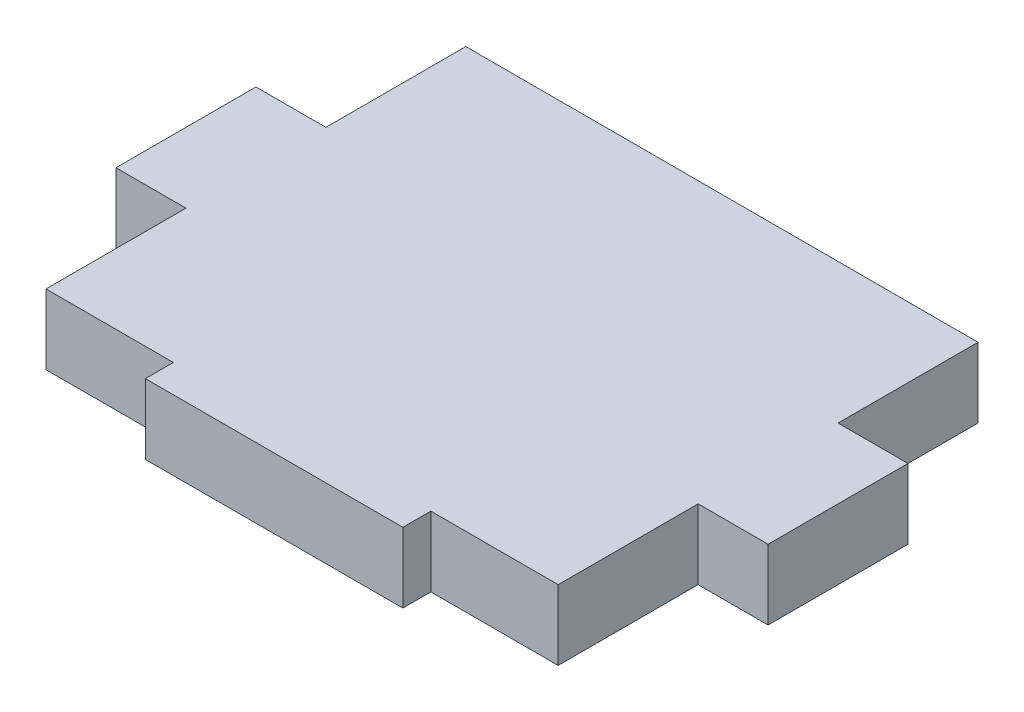
ISO-10303-21;
HEADER;
FILE_DESCRIPTION(('STEP AP214'),'2;1');
FILE_NAME('part.step','',(''),(''),'','','');
FILE_SCHEMA(('AUTOMOTIVE_DESIGN { 1 0 10303 214 1 1 1 1 }'));
ENDSEC;
DATA;
#1=APPLICATION_CONTEXT('core data for automotive mechanical design processes');
#2=APPLICATION_PROTOCOL_DEFINITION('international standard','automotive_design',2000,#1);
#3=PRODUCT_CONTEXT('',#1,'mechanical');
#4=PRODUCT('Part','Part','',(#3));
#5=PRODUCT_RELATED_PRODUCT_CATEGORY('part','',(#4));
#6=PRODUCT_DEFINITION_FORMATION('','',#4);
#7=PRODUCT_DEFINITION_CONTEXT('part definition',#1,'design');
#8=PRODUCT_DEFINITION('design','',#6,#7);
#9=PRODUCT_DEFINITION_SHAPE('','',#8);
#10=(LENGTH_UNIT() NAMED_UNIT(*) SI_UNIT(.MILLI.,.METRE.));
#11=(NAMED_UNIT(*) PLANE_ANGLE_UNIT() SI_UNIT($,.RADIAN.));
#12=(NAMED_UNIT(*) SI_UNIT($,.STERADIAN.) SOLID_ANGLE_UNIT());
#13=UNCERTAINTY_MEASURE_WITH_UNIT(LENGTH_MEASURE(1.E-05),#10,'distance_accuracy_value','');
#14=(GEOMETRIC_REPRESENTATION_CONTEXT(3) GLOBAL_UNCERTAINTY_ASSIGNED_CONTEXT((#13)) GLOBAL_UNIT_ASSIGNED_CONTEXT((#10,
#11,#12)) REPRESENTATION_CONTEXT('',''));
#15=CARTESIAN_POINT('',(0.,0.,0.));
#16=DIRECTION('',(0.,0.,1.));
#17=DIRECTION('',(1.,0.,0.));
#18=AXIS2_PLACEMENT_3D('',#15,#16,#17);
#19=CARTESIAN_POINT('',(23.241,3.175,19.05));
#20=DIRECTION('',(-1.,0.,0.));
#21=DIRECTION('',(0.,0.,1.));
#22=AXIS2_PLACEMENT_3D('',#19,#20,#21);
#23=PLANE('',#22);
#24=DIRECTION('',(0.,1.,0.));
#25=VECTOR('',#24,1.);
#26=CARTESIAN_POINT('',(23.241,-3.175,-6.35));
#27=LINE('',#26,#25);
#28=CARTESIAN_POINT('',(23.241,-3.175,-6.35));
#29=VERTEX_POINT('',#28);
#30=CARTESIAN_POINT('',(23.241,3.175,-6.35));
#31=VERTEX_POINT('',#30);
#32=EDGE_CURVE('E177',#29,#31,#27,.T.);
#33=ORIENTED_EDGE('',*,*,#32,.F.);
#34=DIRECTION('',(0.,0.,-1.));
#35=VECTOR('',#34,1.);
#36=CARTESIAN_POINT('',(23.241,-3.175,19.05));
#37=LINE('',#36,#35);
#38=CARTESIAN_POINT('',(23.241,-3.175,-19.05));
#39=VERTEX_POINT('',#38);
#40=EDGE_CURVE('E218',#29,#39,#37,.T.);
#41=ORIENTED_EDGE('',*,*,#40,.T.);
#42=DIRECTION('',(0.,-1.,0.));
#43=VECTOR('',#42,1.);
#44=CARTESIAN_POINT('',(23.241,3.175,-19.05));
#45=LINE('',#44,#43);
#46=CARTESIAN_POINT('',(23.241,3.175,-19.05));
#47=VERTEX_POINT('',#46);
#48=EDGE_CURVE('E11',#47,#39,#45,.T.);
#49=ORIENTED_EDGE('',*,*,#48,.F.);
#50=DIRECTION('',(0.,0.,-1.));
#51=VECTOR('',#50,1.);
#52=CARTESIAN_POINT('',(23.241,3.175,19.05));
#53=LINE('',#52,#51);
#54=EDGE_CURVE('E272',#31,#47,#53,.T.);
#55=ORIENTED_EDGE('',*,*,#54,.F.);
#56=EDGE_LOOP('',(#33,#41,#49,#55));
#57=FACE_BOUND('',#56,.T.);
#58=ADVANCED_FACE('F32',(#57),#23,.F.);
#59=CARTESIAN_POINT('',(-23.241,3.175,19.05));
#60=DIRECTION('',(1.,0.,0.));
#61=DIRECTION('',(0.,0.,-1.));
#62=AXIS2_PLACEMENT_3D('',#59,#60,#61);
#63=PLANE('',#62);
#64=DIRECTION('',(0.,1.,0.));
#65=VECTOR('',#64,1.);
#66=CARTESIAN_POINT('',(-23.241,-3.175,6.35));
#67=LINE('',#66,#65);
#68=CARTESIAN_POINT('',(-23.241,-3.175,6.35));
#69=VERTEX_POINT('',#68);
#70=CARTESIAN_POINT('',(-23.241,3.175,6.35));
#71=VERTEX_POINT('',#70);
#72=EDGE_CURVE('E200',#69,#71,#67,.T.);
#73=ORIENTED_EDGE('',*,*,#72,.F.);
#74=DIRECTION('',(0.,0.,1.));
#75=VECTOR('',#74,1.);
#76=CARTESIAN_POINT('',(-23.241,-3.175,19.05));
#77=LINE('',#76,#75);
#78=CARTESIAN_POINT('',(-23.241,-3.175,19.05));
#79=VERTEX_POINT('',#78);
#80=EDGE_CURVE('E227',#69,#79,#77,.T.);
#81=ORIENTED_EDGE('',*,*,#80,.T.);
#82=DIRECTION('',(0.,-1.,0.));
#83=VECTOR('',#82,1.);
#84=CARTESIAN_POINT('',(-23.241,3.175,19.05));
#85=LINE('',#84,#83);
#86=CARTESIAN_POINT('',(-23.241,3.175,19.05));
#87=VERTEX_POINT('',#86);
#88=EDGE_CURVE('E327',#87,#79,#85,.T.);
#89=ORIENTED_EDGE('',*,*,#88,.F.);
#90=DIRECTION('',(0.,0.,1.));
#91=VECTOR('',#90,1.);
#92=CARTESIAN_POINT('',(-23.241,3.175,19.05));
#93=LINE('',#92,#91);
#94=EDGE_CURVE('E278',#71,#87,#93,.T.);
#95=ORIENTED_EDGE('',*,*,#94,.F.);
#96=EDGE_LOOP('',(#73,#81,#89,#95));
#97=FACE_BOUND('',#96,.T.);
#98=ADVANCED_FACE('F368',(#97),#63,.F.);
#99=CARTESIAN_POINT('',(-23.241,3.175,19.05));
#100=DIRECTION('',(0.,0.,-1.));
#101=DIRECTION('',(-1.,0.,0.));
#102=AXIS2_PLACEMENT_3D('',#99,#100,#101);
#103=PLANE('',#102);
#104=DIRECTION('',(0.,1.,0.));
#105=VECTOR('',#104,1.);
#106=CARTESIAN_POINT('',(11.684,-3.175,19.05));
#107=LINE('',#106,#105);
#108=CARTESIAN_POINT('',(11.684,-3.175,19.05));
#109=VERTEX_POINT('',#108);
#110=CARTESIAN_POINT('',(11.684,3.175,19.05));
#111=VERTEX_POINT('',#110);
#112=EDGE_CURVE('E253',#109,#111,#107,.T.);
#113=ORIENTED_EDGE('',*,*,#112,.F.);
#114=DIRECTION('',(1.,0.,0.));
#115=VECTOR('',#114,1.);
#116=CARTESIAN_POINT('',(-23.241,-3.175,19.05));
#117=LINE('',#116,#115);
#118=CARTESIAN_POINT('',(23.241,-3.175,19.05));
#119=VERTEX_POINT('',#118);
#120=EDGE_CURVE('E239',#109,#119,#117,.T.);
#121=ORIENTED_EDGE('',*,*,#120,.T.);
#122=DIRECTION('',(0.,-1.,0.));
#123=VECTOR('',#122,1.);
#124=CARTESIAN_POINT('',(23.241,3.175,19.05));
#125=LINE('',#124,#123);
#126=CARTESIAN_POINT('',(23.241,3.175,19.05));
#127=VERTEX_POINT('',#126);
#128=EDGE_CURVE('E294',#127,#119,#125,.T.);
#129=ORIENTED_EDGE('',*,*,#128,.F.);
#130=DIRECTION('',(1.,0.,0.));
#131=VECTOR('',#130,1.);
#132=CARTESIAN_POINT('',(-23.241,3.175,19.05));
#133=LINE('',#132,#131);
#134=EDGE_CURVE('E295',#111,#127,#133,.T.);
#135=ORIENTED_EDGE('',*,*,#134,.F.);
#136=EDGE_LOOP('',(#113,#121,#129,#135));
#137=FACE_BOUND('',#136,.T.);
#138=ADVANCED_FACE('F323',(#137),#103,.F.);
#139=CARTESIAN_POINT('',(23.241,-3.175,6.34999999999999));
#140=VERTEX_POINT('',#139);
#141=EDGE_CURVE('E214',#119,#140,#37,.T.);
#142=ORIENTED_EDGE('',*,*,#141,.T.);
#143=DIRECTION('',(0.,1.,0.));
#144=VECTOR('',#143,1.);
#145=CARTESIAN_POINT('',(23.241,-3.175,6.34999999999999));
#146=LINE('',#145,#144);
#147=CARTESIAN_POINT('',(23.241,3.175,6.35));
#148=VERTEX_POINT('',#147);
#149=EDGE_CURVE('E167',#140,#148,#146,.T.);
#150=ORIENTED_EDGE('',*,*,#149,.T.);
#151=EDGE_CURVE('E274',#127,#148,#53,.T.);
#152=ORIENTED_EDGE('',*,*,#151,.F.);
#153=ORIENTED_EDGE('',*,*,#128,.T.);
#154=EDGE_LOOP('',(#142,#150,#152,#153));
#155=FACE_BOUND('',#154,.T.);
#156=ADVANCED_FACE('F34',(#155),#23,.F.);
#157=CARTESIAN_POINT('',(-23.241,3.175,-19.05));
#158=DIRECTION('',(0.,0.,1.));
#159=DIRECTION('',(1.,0.,0.));
#160=AXIS2_PLACEMENT_3D('',#157,#158,#159);
#161=PLANE('',#160);
#162=DIRECTION('',(-1.,0.,0.));
#163=VECTOR('',#162,1.);
#164=CARTESIAN_POINT('',(-23.241,-3.175,-19.05));
#165=LINE('',#164,#163);
#166=CARTESIAN_POINT('',(-23.241,-3.175,-19.05));
#167=VERTEX_POINT('',#166);
#168=EDGE_CURVE('E217',#39,#167,#165,.T.);
#169=ORIENTED_EDGE('',*,*,#168,.T.);
#170=DIRECTION('',(0.,-1.,0.));
#171=VECTOR('',#170,1.);
#172=CARTESIAN_POINT('',(-23.241,3.175,-19.05));
#173=LINE('',#172,#171);
#174=CARTESIAN_POINT('',(-23.241,3.175,-19.05));
#175=VERTEX_POINT('',#174);
#176=EDGE_CURVE('E41',#175,#167,#173,.T.);
#177=ORIENTED_EDGE('',*,*,#176,.F.);
#178=DIRECTION('',(-1.,0.,0.));
#179=VECTOR('',#178,1.);
#180=CARTESIAN_POINT('',(-23.241,3.175,-19.05));
#181=LINE('',#180,#179);
#182=EDGE_CURVE('E269',#47,#175,#181,.T.);
#183=ORIENTED_EDGE('',*,*,#182,.F.);
#184=ORIENTED_EDGE('',*,*,#48,.T.);
#185=EDGE_LOOP('',(#169,#177,#183,#184));
#186=FACE_BOUND('',#185,.T.);
#187=ADVANCED_FACE('F351',(#186),#161,.F.);
#188=CARTESIAN_POINT('',(-23.241,-3.175,-6.35));
#189=VERTEX_POINT('',#188);
#190=EDGE_CURVE('E236',#167,#189,#77,.T.);
#191=ORIENTED_EDGE('',*,*,#190,.T.);
#192=DIRECTION('',(0.,1.,0.));
#193=VECTOR('',#192,1.);
#194=CARTESIAN_POINT('',(-23.241,-3.175,-6.35));
#195=LINE('',#194,#193);
#196=CARTESIAN_POINT('',(-23.241,3.175,-6.34999999999998));
#197=VERTEX_POINT('',#196);
#198=EDGE_CURVE('E207',#189,#197,#195,.T.);
#199=ORIENTED_EDGE('',*,*,#198,.T.);
#200=EDGE_CURVE('E297',#175,#197,#93,.T.);
#201=ORIENTED_EDGE('',*,*,#200,.F.);
#202=ORIENTED_EDGE('',*,*,#176,.T.);
#203=EDGE_LOOP('',(#191,#199,#201,#202));
#204=FACE_BOUND('',#203,.T.);
#205=ADVANCED_FACE('F334',(#204),#63,.F.);
#206=CARTESIAN_POINT('',(-11.684,-3.175,19.05));
#207=VERTEX_POINT('',#206);
#208=EDGE_CURVE('E279',#79,#207,#117,.T.);
#209=ORIENTED_EDGE('',*,*,#208,.T.);
#210=DIRECTION('',(0.,1.,0.));
#211=VECTOR('',#210,1.);
#212=CARTESIAN_POINT('',(-11.684,-3.175,19.05));
#213=LINE('',#212,#211);
#214=CARTESIAN_POINT('',(-11.684,3.175,19.05));
#215=VERTEX_POINT('',#214);
#216=EDGE_CURVE('E256',#207,#215,#213,.T.);
#217=ORIENTED_EDGE('',*,*,#216,.T.);
#218=EDGE_CURVE('E291',#87,#215,#133,.T.);
#219=ORIENTED_EDGE('',*,*,#218,.F.);
#220=ORIENTED_EDGE('',*,*,#88,.T.);
#221=EDGE_LOOP('',(#209,#217,#219,#220));
#222=FACE_BOUND('',#221,.T.);
#223=ADVANCED_FACE('F380',(#222),#103,.F.);
#224=CARTESIAN_POINT('',(23.241,3.175,-19.05));
#225=DIRECTION('',(0.,-1.,0.));
#226=DIRECTION('',(0.,0.,-1.));
#227=AXIS2_PLACEMENT_3D('',#224,#225,#226);
#228=PLANE('',#227);
#229=ORIENTED_EDGE('',*,*,#151,.T.);
#230=DIRECTION('',(1.,0.,0.));
#231=VECTOR('',#230,1.);
#232=CARTESIAN_POINT('',(23.241,3.175,6.34999999999999));
#233=LINE('',#232,#231);
#234=CARTESIAN_POINT('',(29.591,3.175,6.34999999999999));
#235=VERTEX_POINT('',#234);
#236=EDGE_CURVE('E49',#148,#235,#233,.T.);
#237=ORIENTED_EDGE('',*,*,#236,.T.);
#238=DIRECTION('',(0.,0.,-1.));
#239=VECTOR('',#238,1.);
#240=CARTESIAN_POINT('',(29.591,3.175,6.34999999999999));
#241=LINE('',#240,#239);
#242=CARTESIAN_POINT('',(29.591,3.175,-6.35));
#243=VERTEX_POINT('',#242);
#244=EDGE_CURVE('E152',#235,#243,#241,.T.);
#245=ORIENTED_EDGE('',*,*,#244,.T.);
#246=DIRECTION('',(-1.,0.,0.));
#247=VECTOR('',#246,1.);
#248=CARTESIAN_POINT('',(23.241,3.175,-6.35));
#249=LINE('',#248,#247);
#250=EDGE_CURVE('E168',#243,#31,#249,.T.);
#251=ORIENTED_EDGE('',*,*,#250,.T.);
#252=ORIENTED_EDGE('',*,*,#54,.T.);
#253=ORIENTED_EDGE('',*,*,#182,.T.);
#254=ORIENTED_EDGE('',*,*,#200,.T.);
#255=DIRECTION('',(-1.,0.,0.));
#256=VECTOR('',#255,1.);
#257=CARTESIAN_POINT('',(-23.241,3.175,-6.35));
#258=LINE('',#257,#256);
#259=CARTESIAN_POINT('',(-29.591,3.175,-6.35));
#260=VERTEX_POINT('',#259);
#261=EDGE_CURVE('E57',#197,#260,#258,.T.);
#262=ORIENTED_EDGE('',*,*,#261,.T.);
#263=DIRECTION('',(0.,0.,1.));
#264=VECTOR('',#263,1.);
#265=CARTESIAN_POINT('',(-29.591,3.175,6.35));
#266=LINE('',#265,#264);
#267=CARTESIAN_POINT('',(-29.591,3.175,6.35));
#268=VERTEX_POINT('',#267);
#269=EDGE_CURVE('E191',#260,#268,#266,.T.);
#270=ORIENTED_EDGE('',*,*,#269,.T.);
#271=DIRECTION('',(1.,0.,0.));
#272=VECTOR('',#271,1.);
#273=CARTESIAN_POINT('',(-23.241,3.175,6.35));
#274=LINE('',#273,#272);
#275=EDGE_CURVE('E194',#268,#71,#274,.T.);
#276=ORIENTED_EDGE('',*,*,#275,.T.);
#277=ORIENTED_EDGE('',*,*,#94,.T.);
#278=ORIENTED_EDGE('',*,*,#218,.T.);
#279=DIRECTION('',(0.,0.,1.));
#280=VECTOR('',#279,1.);
#281=CARTESIAN_POINT('',(-11.684,3.175,19.05));
#282=LINE('',#281,#280);
#283=CARTESIAN_POINT('',(-11.684,3.175,21.59));
#284=VERTEX_POINT('',#283);
#285=EDGE_CURVE('E203',#215,#284,#282,.T.);
#286=ORIENTED_EDGE('',*,*,#285,.T.);
#287=DIRECTION('',(1.,0.,0.));
#288=VECTOR('',#287,1.);
#289=CARTESIAN_POINT('',(-11.684,3.175,21.59));
#290=LINE('',#289,#288);
#291=CARTESIAN_POINT('',(11.684,3.175,21.59));
#292=VERTEX_POINT('',#291);
#293=EDGE_CURVE('E246',#284,#292,#290,.T.);
#294=ORIENTED_EDGE('',*,*,#293,.T.);
#295=DIRECTION('',(0.,0.,-1.));
#296=VECTOR('',#295,1.);
#297=CARTESIAN_POINT('',(11.684,3.175,19.05));
#298=LINE('',#297,#296);
#299=EDGE_CURVE('E242',#292,#111,#298,.T.);
#300=ORIENTED_EDGE('',*,*,#299,.T.);
#301=ORIENTED_EDGE('',*,*,#134,.T.);
#302=EDGE_LOOP('',(#229,#237,#245,#251,#252,#253,#254,#262,#270,#276,#277,#278,#286,#294,#300,#301));
#303=FACE_BOUND('',#302,.T.);
#304=ADVANCED_FACE('F313',(#303),#228,.F.);
#305=CARTESIAN_POINT('',(23.241,-3.175,-19.05));
#306=DIRECTION('',(0.,-1.,0.));
#307=DIRECTION('',(0.,0.,-1.));
#308=AXIS2_PLACEMENT_3D('',#305,#306,#307);
#309=PLANE('',#308);
#310=ORIENTED_EDGE('',*,*,#141,.F.);
#311=ORIENTED_EDGE('',*,*,#120,.F.);
#312=DIRECTION('',(0.,0.,-1.));
#313=VECTOR('',#312,1.);
#314=CARTESIAN_POINT('',(11.684,-3.175,19.05));
#315=LINE('',#314,#313);
#316=CARTESIAN_POINT('',(11.684,-3.175,21.59));
#317=VERTEX_POINT('',#316);
#318=EDGE_CURVE('E249',#317,#109,#315,.T.);
#319=ORIENTED_EDGE('',*,*,#318,.F.);
#320=DIRECTION('',(1.,0.,0.));
#321=VECTOR('',#320,1.);
#322=CARTESIAN_POINT('',(-11.684,-3.175,21.59));
#323=LINE('',#322,#321);
#324=CARTESIAN_POINT('',(-11.684,-3.175,21.59));
#325=VERTEX_POINT('',#324);
#326=EDGE_CURVE('E252',#325,#317,#323,.T.);
#327=ORIENTED_EDGE('',*,*,#326,.F.);
#328=DIRECTION('',(0.,0.,1.));
#329=VECTOR('',#328,1.);
#330=CARTESIAN_POINT('',(-11.684,-3.175,19.05));
#331=LINE('',#330,#329);
#332=EDGE_CURVE('E245',#207,#325,#331,.T.);
#333=ORIENTED_EDGE('',*,*,#332,.F.);
#334=ORIENTED_EDGE('',*,*,#208,.F.);
#335=ORIENTED_EDGE('',*,*,#80,.F.);
#336=DIRECTION('',(1.,0.,0.));
#337=VECTOR('',#336,1.);
#338=CARTESIAN_POINT('',(-23.241,-3.175,6.35));
#339=LINE('',#338,#337);
#340=CARTESIAN_POINT('',(-29.591,-3.175,6.35));
#341=VERTEX_POINT('',#340);
#342=EDGE_CURVE('E189',#341,#69,#339,.T.);
#343=ORIENTED_EDGE('',*,*,#342,.F.);
#344=DIRECTION('',(0.,0.,1.));
#345=VECTOR('',#344,1.);
#346=CARTESIAN_POINT('',(-29.591,-3.175,6.35));
#347=LINE('',#346,#345);
#348=CARTESIAN_POINT('',(-29.591,-3.175,-6.35));
#349=VERTEX_POINT('',#348);
#350=EDGE_CURVE('E186',#349,#341,#347,.T.);
#351=ORIENTED_EDGE('',*,*,#350,.F.);
#352=DIRECTION('',(-1.,0.,0.));
#353=VECTOR('',#352,1.);
#354=CARTESIAN_POINT('',(-23.241,-3.175,-6.35));
#355=LINE('',#354,#353);
#356=EDGE_CURVE('E190',#189,#349,#355,.T.);
#357=ORIENTED_EDGE('',*,*,#356,.F.);
#358=ORIENTED_EDGE('',*,*,#190,.F.);
#359=ORIENTED_EDGE('',*,*,#168,.F.);
#360=ORIENTED_EDGE('',*,*,#40,.F.);
#361=DIRECTION('',(-1.,0.,0.));
#362=VECTOR('',#361,1.);
#363=CARTESIAN_POINT('',(23.241,-3.175,-6.35));
#364=LINE('',#363,#362);
#365=CARTESIAN_POINT('',(29.591,-3.175,-6.35));
#366=VERTEX_POINT('',#365);
#367=EDGE_CURVE('E155',#366,#29,#364,.T.);
#368=ORIENTED_EDGE('',*,*,#367,.F.);
#369=DIRECTION('',(0.,0.,-1.));
#370=VECTOR('',#369,1.);
#371=CARTESIAN_POINT('',(29.591,-3.175,6.34999999999999));
#372=LINE('',#371,#370);
#373=CARTESIAN_POINT('',(29.591,-3.175,6.34999999999999));
#374=VERTEX_POINT('',#373);
#375=EDGE_CURVE('E150',#374,#366,#372,.T.);
#376=ORIENTED_EDGE('',*,*,#375,.F.);
#377=DIRECTION('',(1.,0.,0.));
#378=VECTOR('',#377,1.);
#379=CARTESIAN_POINT('',(23.241,-3.175,6.34999999999999));
#380=LINE('',#379,#378);
#381=EDGE_CURVE('E162',#140,#374,#380,.T.);
#382=ORIENTED_EDGE('',*,*,#381,.F.);
#383=EDGE_LOOP('',(#310,#311,#319,#327,#333,#334,#335,#343,#351,#357,#358,#359,#360,#368,#376,#382));
#384=FACE_BOUND('',#383,.T.);
#385=ADVANCED_FACE('F161',(#384),#309,.T.);
#386=CARTESIAN_POINT('',(-11.684,-3.175,19.05));
#387=DIRECTION('',(-1.,0.,0.));
#388=DIRECTION('',(0.,0.,1.));
#389=AXIS2_PLACEMENT_3D('',#386,#387,#388);
#390=PLANE('',#389);
#391=ORIENTED_EDGE('',*,*,#285,.F.);
#392=ORIENTED_EDGE('',*,*,#216,.F.);
#393=ORIENTED_EDGE('',*,*,#332,.T.);
#394=DIRECTION('',(0.,1.,0.));
#395=VECTOR('',#394,1.);
#396=CARTESIAN_POINT('',(-11.684,-3.175,21.59));
#397=LINE('',#396,#395);
#398=EDGE_CURVE('E251',#325,#284,#397,.T.);
#399=ORIENTED_EDGE('',*,*,#398,.T.);
#400=EDGE_LOOP('',(#391,#392,#393,#399));
#401=FACE_BOUND('',#400,.T.);
#402=ADVANCED_FACE('F425',(#401),#390,.T.);
#403=CARTESIAN_POINT('',(11.684,-3.175,19.05));
#404=DIRECTION('',(1.,0.,0.));
#405=DIRECTION('',(0.,0.,-1.));
#406=AXIS2_PLACEMENT_3D('',#403,#404,#405);
#407=PLANE('',#406);
#408=ORIENTED_EDGE('',*,*,#299,.F.);
#409=DIRECTION('',(0.,1.,0.));
#410=VECTOR('',#409,1.);
#411=CARTESIAN_POINT('',(11.684,-3.175,21.59));
#412=LINE('',#411,#410);
#413=EDGE_CURVE('E257',#317,#292,#412,.T.);
#414=ORIENTED_EDGE('',*,*,#413,.F.);
#415=ORIENTED_EDGE('',*,*,#318,.T.);
#416=ORIENTED_EDGE('',*,*,#112,.T.);
#417=EDGE_LOOP('',(#408,#414,#415,#416));
#418=FACE_BOUND('',#417,.T.);
#419=ADVANCED_FACE('F319',(#418),#407,.T.);
#420=CARTESIAN_POINT('',(-11.684,-3.175,21.59));
#421=DIRECTION('',(0.,0.,1.));
#422=DIRECTION('',(1.,0.,0.));
#423=AXIS2_PLACEMENT_3D('',#420,#421,#422);
#424=PLANE('',#423);
#425=ORIENTED_EDGE('',*,*,#293,.F.);
#426=ORIENTED_EDGE('',*,*,#398,.F.);
#427=ORIENTED_EDGE('',*,*,#326,.T.);
#428=ORIENTED_EDGE('',*,*,#413,.T.);
#429=EDGE_LOOP('',(#425,#426,#427,#428));
#430=FACE_BOUND('',#429,.T.);
#431=ADVANCED_FACE('F316',(#430),#424,.T.);
#432=CARTESIAN_POINT('',(-23.241,-3.175,6.35));
#433=DIRECTION('',(0.,0.,1.));
#434=DIRECTION('',(1.,0.,0.));
#435=AXIS2_PLACEMENT_3D('',#432,#433,#434);
#436=PLANE('',#435);
#437=ORIENTED_EDGE('',*,*,#275,.F.);
#438=DIRECTION('',(0.,1.,0.));
#439=VECTOR('',#438,1.);
#440=CARTESIAN_POINT('',(-29.591,-3.175,6.35));
#441=LINE('',#440,#439);
#442=EDGE_CURVE('E197',#341,#268,#441,.T.);
#443=ORIENTED_EDGE('',*,*,#442,.F.);
#444=ORIENTED_EDGE('',*,*,#342,.T.);
#445=ORIENTED_EDGE('',*,*,#72,.T.);
#446=EDGE_LOOP('',(#437,#443,#444,#445));
#447=FACE_BOUND('',#446,.T.);
#448=ADVANCED_FACE('F473',(#447),#436,.T.);
#449=CARTESIAN_POINT('',(-29.591,-3.175,6.35));
#450=DIRECTION('',(-1.,0.,0.));
#451=DIRECTION('',(0.,0.,1.));
#452=AXIS2_PLACEMENT_3D('',#449,#450,#451);
#453=PLANE('',#452);
#454=ORIENTED_EDGE('',*,*,#269,.F.);
#455=DIRECTION('',(0.,1.,0.));
#456=VECTOR('',#455,1.);
#457=CARTESIAN_POINT('',(-29.591,-3.175,-6.35));
#458=LINE('',#457,#456);
#459=EDGE_CURVE('E344',#349,#260,#458,.T.);
#460=ORIENTED_EDGE('',*,*,#459,.F.);
#461=ORIENTED_EDGE('',*,*,#350,.T.);
#462=ORIENTED_EDGE('',*,*,#442,.T.);
#463=EDGE_LOOP('',(#454,#460,#461,#462));
#464=FACE_BOUND('',#463,.T.);
#465=ADVANCED_FACE('F482',(#464),#453,.T.);
#466=CARTESIAN_POINT('',(-23.241,-3.175,-6.35));
#467=DIRECTION('',(0.,0.,-1.));
#468=DIRECTION('',(-1.,0.,0.));
#469=AXIS2_PLACEMENT_3D('',#466,#467,#468);
#470=PLANE('',#469);
#471=ORIENTED_EDGE('',*,*,#261,.F.);
#472=ORIENTED_EDGE('',*,*,#198,.F.);
#473=ORIENTED_EDGE('',*,*,#356,.T.);
#474=ORIENTED_EDGE('',*,*,#459,.T.);
#475=EDGE_LOOP('',(#471,#472,#473,#474));
#476=FACE_BOUND('',#475,.T.);
#477=ADVANCED_FACE('F365',(#476),#470,.T.);
#478=CARTESIAN_POINT('',(23.241,-3.175,6.34999999999999));
#479=DIRECTION('',(0.,0.,1.));
#480=DIRECTION('',(1.,0.,0.));
#481=AXIS2_PLACEMENT_3D('',#478,#479,#480);
#482=PLANE('',#481);
#483=ORIENTED_EDGE('',*,*,#236,.F.);
#484=ORIENTED_EDGE('',*,*,#149,.F.);
#485=ORIENTED_EDGE('',*,*,#381,.T.);
#486=DIRECTION('',(0.,1.,0.));
#487=VECTOR('',#486,1.);
#488=CARTESIAN_POINT('',(29.591,-3.175,6.34999999999999));
#489=LINE('',#488,#487);
#490=EDGE_CURVE('E147',#374,#235,#489,.T.);
#491=ORIENTED_EDGE('',*,*,#490,.T.);
#492=EDGE_LOOP('',(#483,#484,#485,#491));
#493=FACE_BOUND('',#492,.T.);
#494=ADVANCED_FACE('F166',(#493),#482,.T.);
#495=CARTESIAN_POINT('',(23.241,-3.175,-6.35));
#496=DIRECTION('',(0.,0.,-1.));
#497=DIRECTION('',(-1.,0.,0.));
#498=AXIS2_PLACEMENT_3D('',#495,#496,#497);
#499=PLANE('',#498);
#500=ORIENTED_EDGE('',*,*,#250,.F.);
#501=DIRECTION('',(0.,1.,0.));
#502=VECTOR('',#501,1.);
#503=CARTESIAN_POINT('',(29.591,-3.175,-6.35));
#504=LINE('',#503,#502);
#505=EDGE_CURVE('E154',#366,#243,#504,.T.);
#506=ORIENTED_EDGE('',*,*,#505,.F.);
#507=ORIENTED_EDGE('',*,*,#367,.T.);
#508=ORIENTED_EDGE('',*,*,#32,.T.);
#509=EDGE_LOOP('',(#500,#506,#507,#508));
#510=FACE_BOUND('',#509,.T.);
#511=ADVANCED_FACE('F356',(#510),#499,.T.);
#512=CARTESIAN_POINT('',(29.591,-3.175,6.34999999999999));
#513=DIRECTION('',(1.,0.,0.));
#514=DIRECTION('',(0.,0.,-1.));
#515=AXIS2_PLACEMENT_3D('',#512,#513,#514);
#516=PLANE('',#515);
#517=ORIENTED_EDGE('',*,*,#244,.F.);
#518=ORIENTED_EDGE('',*,*,#490,.F.);
#519=ORIENTED_EDGE('',*,*,#375,.T.);
#520=ORIENTED_EDGE('',*,*,#505,.T.);
#521=EDGE_LOOP('',(#517,#518,#519,#520));
#522=FACE_BOUND('',#521,.T.);
#523=ADVANCED_FACE('F149',(#522),#516,.T.);
#524=CLOSED_SHELL('',(#58,#98,#138,#156,#187,#205,#223,#304,#385,#402,#419,#431,#448,#465,#477,
#494,#511,#523));
#525=MANIFOLD_SOLID_BREP('B2',#524);
#526=ADVANCED_BREP_SHAPE_REPRESENTATION('',(#18,#525),#14);
#527=SHAPE_DEFINITION_REPRESENTATION(#9,#526);
ENDSEC;
END-ISO-10303-21;
